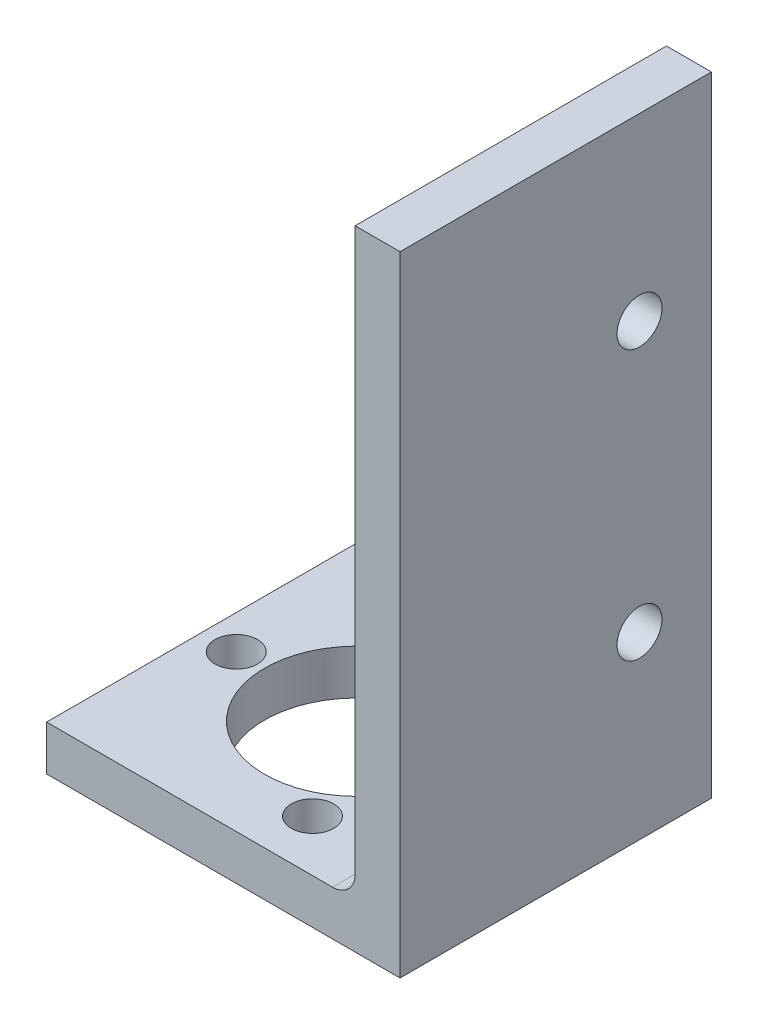
ISO-10303-21;
HEADER;
FILE_DESCRIPTION(('STEP AP214'),'2;1');
FILE_NAME('part.step','',(''),(''),'','','');
FILE_SCHEMA(('AUTOMOTIVE_DESIGN { 1 0 10303 214 1 1 1 1 }'));
ENDSEC;
DATA;
#1=APPLICATION_CONTEXT('core data for automotive mechanical design processes');
#2=APPLICATION_PROTOCOL_DEFINITION('international standard','automotive_design',2000,#1);
#3=PRODUCT_CONTEXT('',#1,'mechanical');
#4=PRODUCT('Part','Part','',(#3));
#5=PRODUCT_RELATED_PRODUCT_CATEGORY('part','',(#4));
#6=PRODUCT_DEFINITION_FORMATION('','',#4);
#7=PRODUCT_DEFINITION_CONTEXT('part definition',#1,'design');
#8=PRODUCT_DEFINITION('design','',#6,#7);
#9=PRODUCT_DEFINITION_SHAPE('','',#8);
#10=(LENGTH_UNIT() NAMED_UNIT(*) SI_UNIT(.MILLI.,.METRE.));
#11=(NAMED_UNIT(*) PLANE_ANGLE_UNIT() SI_UNIT($,.RADIAN.));
#12=(NAMED_UNIT(*) SI_UNIT($,.STERADIAN.) SOLID_ANGLE_UNIT());
#13=UNCERTAINTY_MEASURE_WITH_UNIT(LENGTH_MEASURE(1.E-05),#10,'distance_accuracy_value','');
#14=(GEOMETRIC_REPRESENTATION_CONTEXT(3) GLOBAL_UNCERTAINTY_ASSIGNED_CONTEXT((#13)) GLOBAL_UNIT_ASSIGNED_CONTEXT((#10,
#11,#12)) REPRESENTATION_CONTEXT('',''));
#15=CARTESIAN_POINT('',(0.,0.,0.));
#16=DIRECTION('',(0.,0.,1.));
#17=DIRECTION('',(1.,0.,0.));
#18=AXIS2_PLACEMENT_3D('',#15,#16,#17);
#19=CARTESIAN_POINT('',(-25.4,0.,11.));
#20=DIRECTION('',(0.,1.,0.));
#21=DIRECTION('',(0.,0.,1.));
#22=AXIS2_PLACEMENT_3D('',#19,#20,#21);
#23=PLANE('',#22);
#24=CARTESIAN_POINT('',(2.82500000000003,0.,0.));
#25=DIRECTION('',(0.,-1.,0.));
#26=DIRECTION('',(0.,0.,-1.));
#27=AXIS2_PLACEMENT_3D('',#24,#25,#26);
#28=CIRCLE('',#27,1.5);
#29=CARTESIAN_POINT('',(2.82500000000003,0.,-1.50000000000003));
#30=VERTEX_POINT('',#29);
#31=EDGE_CURVE('E114',#30,#30,#28,.T.);
#32=ORIENTED_EDGE('',*,*,#31,.F.);
#33=EDGE_LOOP('',(#32));
#34=FACE_BOUND('',#33,.T.);
#35=CARTESIAN_POINT('',(15.575,0.,7.3612159322));
#36=DIRECTION('',(0.,-1.,0.));
#37=DIRECTION('',(0.,0.,-1.));
#38=AXIS2_PLACEMENT_3D('',#35,#36,#37);
#39=CIRCLE('',#38,1.5);
#40=CARTESIAN_POINT('',(15.575,0.,5.8612159322));
#41=VERTEX_POINT('',#40);
#42=EDGE_CURVE('E192',#41,#41,#39,.T.);
#43=ORIENTED_EDGE('',*,*,#42,.F.);
#44=EDGE_LOOP('',(#43));
#45=FACE_BOUND('',#44,.T.);
#46=CARTESIAN_POINT('',(11.325,0.,0.));
#47=DIRECTION('',(0.,-1.,0.));
#48=DIRECTION('',(0.,0.,-1.));
#49=AXIS2_PLACEMENT_3D('',#46,#47,#48);
#50=CIRCLE('',#49,6.5);
#51=CARTESIAN_POINT('',(11.325,0.,-6.50000000000001));
#52=VERTEX_POINT('',#51);
#53=EDGE_CURVE('E178',#52,#52,#50,.T.);
#54=ORIENTED_EDGE('',*,*,#53,.F.);
#55=EDGE_LOOP('',(#54));
#56=FACE_BOUND('',#55,.T.);
#57=CARTESIAN_POINT('',(15.575,0.,-7.36121593220001));
#58=DIRECTION('',(0.,-1.,0.));
#59=DIRECTION('',(0.,0.,-1.));
#60=AXIS2_PLACEMENT_3D('',#57,#58,#59);
#61=CIRCLE('',#60,1.49999999999999);
#62=CARTESIAN_POINT('',(15.575,0.,-8.8612159322));
#63=VERTEX_POINT('',#62);
#64=EDGE_CURVE('E189',#63,#63,#61,.T.);
#65=ORIENTED_EDGE('',*,*,#64,.F.);
#66=EDGE_LOOP('',(#65));
#67=FACE_BOUND('',#66,.T.);
#68=DIRECTION('',(0.,0.,-1.));
#69=VECTOR('',#68,1.);
#70=CARTESIAN_POINT('',(0.425000000000033,0.,0.));
#71=LINE('',#70,#69);
#72=CARTESIAN_POINT('',(0.425000000000033,0.,11.));
#73=VERTEX_POINT('',#72);
#74=CARTESIAN_POINT('',(0.425000000000033,0.,-11.));
#75=VERTEX_POINT('',#74);
#76=EDGE_CURVE('E107',#73,#75,#71,.T.);
#77=ORIENTED_EDGE('',*,*,#76,.T.);
#78=DIRECTION('',(1.,0.,0.));
#79=VECTOR('',#78,1.);
#80=CARTESIAN_POINT('',(-25.4,0.,-11.));
#81=LINE('',#80,#79);
#82=CARTESIAN_POINT('',(25.4,0.,-11.));
#83=VERTEX_POINT('',#82);
#84=EDGE_CURVE('E141',#75,#83,#81,.T.);
#85=ORIENTED_EDGE('',*,*,#84,.T.);
#86=DIRECTION('',(0.,0.,-1.));
#87=VECTOR('',#86,1.);
#88=CARTESIAN_POINT('',(25.4,0.,11.));
#89=LINE('',#88,#87);
#90=CARTESIAN_POINT('',(25.4,0.,11.));
#91=VERTEX_POINT('',#90);
#92=EDGE_CURVE('E126',#91,#83,#89,.T.);
#93=ORIENTED_EDGE('',*,*,#92,.F.);
#94=DIRECTION('',(1.,0.,0.));
#95=VECTOR('',#94,1.);
#96=CARTESIAN_POINT('',(-25.4,0.,11.));
#97=LINE('',#96,#95);
#98=EDGE_CURVE('E120',#73,#91,#97,.T.);
#99=ORIENTED_EDGE('',*,*,#98,.F.);
#100=EDGE_LOOP('',(#77,#85,#93,#99));
#101=FACE_BOUND('',#100,.T.);
#102=ADVANCED_FACE('F49',(#34,#45,#56,#67,#101),#23,.F.);
#103=CARTESIAN_POINT('',(22.225,3.17499999999999,11.));
#104=DIRECTION('',(0.,-1.,0.));
#105=DIRECTION('',(1.,0.,0.));
#106=AXIS2_PLACEMENT_3D('',#103,#104,#105);
#107=PLANE('',#106);
#108=CARTESIAN_POINT('',(2.82500000000003,3.175,0.));
#109=DIRECTION('',(0.,-1.,0.));
#110=DIRECTION('',(1.,0.,0.));
#111=AXIS2_PLACEMENT_3D('',#108,#109,#110);
#112=CIRCLE('',#111,1.5);
#113=CARTESIAN_POINT('',(4.32500000000003,3.175,0.));
#114=VERTEX_POINT('',#113);
#115=EDGE_CURVE('E160',#114,#114,#112,.T.);
#116=ORIENTED_EDGE('',*,*,#115,.T.);
#117=EDGE_LOOP('',(#116));
#118=FACE_BOUND('',#117,.T.);
#119=CARTESIAN_POINT('',(15.575,3.175,7.3612159322));
#120=DIRECTION('',(0.,-1.,0.));
#121=DIRECTION('',(1.,0.,0.));
#122=AXIS2_PLACEMENT_3D('',#119,#120,#121);
#123=CIRCLE('',#122,1.5);
#124=CARTESIAN_POINT('',(17.075,3.175,7.3612159322));
#125=VERTEX_POINT('',#124);
#126=EDGE_CURVE('E163',#125,#125,#123,.T.);
#127=ORIENTED_EDGE('',*,*,#126,.T.);
#128=EDGE_LOOP('',(#127));
#129=FACE_BOUND('',#128,.T.);
#130=CARTESIAN_POINT('',(11.325,3.175,0.));
#131=DIRECTION('',(0.,-1.,0.));
#132=DIRECTION('',(1.,0.,0.));
#133=AXIS2_PLACEMENT_3D('',#130,#131,#132);
#134=CIRCLE('',#133,6.5);
#135=CARTESIAN_POINT('',(17.825,3.175,0.));
#136=VERTEX_POINT('',#135);
#137=EDGE_CURVE('E166',#136,#136,#134,.T.);
#138=ORIENTED_EDGE('',*,*,#137,.T.);
#139=EDGE_LOOP('',(#138));
#140=FACE_BOUND('',#139,.T.);
#141=CARTESIAN_POINT('',(15.575,3.175,-7.36121593220001));
#142=DIRECTION('',(0.,-1.,0.));
#143=DIRECTION('',(1.,0.,0.));
#144=AXIS2_PLACEMENT_3D('',#141,#142,#143);
#145=CIRCLE('',#144,1.49999999999999);
#146=CARTESIAN_POINT('',(17.075,3.175,-7.36121593220001));
#147=VERTEX_POINT('',#146);
#148=EDGE_CURVE('E169',#147,#147,#145,.T.);
#149=ORIENTED_EDGE('',*,*,#148,.T.);
#150=EDGE_LOOP('',(#149));
#151=FACE_BOUND('',#150,.T.);
#152=DIRECTION('',(0.,0.,-1.));
#153=VECTOR('',#152,1.);
#154=CARTESIAN_POINT('',(0.425000000000033,3.17499999999999,11.));
#155=LINE('',#154,#153);
#156=CARTESIAN_POINT('',(0.425000000000033,3.175,11.));
#157=VERTEX_POINT('',#156);
#158=CARTESIAN_POINT('',(0.425000000000033,3.17499999999999,-11.));
#159=VERTEX_POINT('',#158);
#160=EDGE_CURVE('E65',#157,#159,#155,.T.);
#161=ORIENTED_EDGE('',*,*,#160,.F.);
#162=DIRECTION('',(-1.,0.,0.));
#163=VECTOR('',#162,1.);
#164=CARTESIAN_POINT('',(22.225,3.17499999999999,11.));
#165=LINE('',#164,#163);
#166=CARTESIAN_POINT('',(20.6375,3.17499999999999,11.));
#167=VERTEX_POINT('',#166);
#168=EDGE_CURVE('E123',#167,#157,#165,.T.);
#169=ORIENTED_EDGE('',*,*,#168,.F.);
#170=DIRECTION('',(0.,0.,-1.));
#171=VECTOR('',#170,1.);
#172=CARTESIAN_POINT('',(20.6375,3.17499999999999,-11.));
#173=LINE('',#172,#171);
#174=CARTESIAN_POINT('',(20.6375,3.17499999999999,-11.));
#175=VERTEX_POINT('',#174);
#176=EDGE_CURVE('E148',#167,#175,#173,.T.);
#177=ORIENTED_EDGE('',*,*,#176,.T.);
#178=DIRECTION('',(-1.,0.,0.));
#179=VECTOR('',#178,1.);
#180=CARTESIAN_POINT('',(22.225,3.17499999999999,-11.));
#181=LINE('',#180,#179);
#182=EDGE_CURVE('E129',#175,#159,#181,.T.);
#183=ORIENTED_EDGE('',*,*,#182,.T.);
#184=EDGE_LOOP('',(#161,#169,#177,#183));
#185=FACE_BOUND('',#184,.T.);
#186=ADVANCED_FACE('F213',(#118,#129,#140,#151,#185),#107,.F.);
#187=CARTESIAN_POINT('',(-25.4,3.175,11.));
#188=DIRECTION('',(0.,0.,1.));
#189=DIRECTION('',(1.,0.,0.));
#190=AXIS2_PLACEMENT_3D('',#187,#188,#189);
#191=PLANE('',#190);
#192=ORIENTED_EDGE('',*,*,#168,.T.);
#193=DIRECTION('',(0.,-1.,0.));
#194=VECTOR('',#193,1.);
#195=CARTESIAN_POINT('',(0.425000000000033,44.45,11.));
#196=LINE('',#195,#194);
#197=EDGE_CURVE('E110',#157,#73,#196,.T.);
#198=ORIENTED_EDGE('',*,*,#197,.T.);
#199=ORIENTED_EDGE('',*,*,#98,.T.);
#200=DIRECTION('',(0.,1.,0.));
#201=VECTOR('',#200,1.);
#202=CARTESIAN_POINT('',(25.4,0.,11.));
#203=LINE('',#202,#201);
#204=CARTESIAN_POINT('',(25.4,44.45,11.));
#205=VERTEX_POINT('',#204);
#206=EDGE_CURVE('E128',#91,#205,#203,.T.);
#207=ORIENTED_EDGE('',*,*,#206,.T.);
#208=DIRECTION('',(1.,0.,0.));
#209=VECTOR('',#208,1.);
#210=CARTESIAN_POINT('',(6.05907768448333,44.45,11.));
#211=LINE('',#210,#209);
#212=CARTESIAN_POINT('',(22.225,44.45,11.));
#213=VERTEX_POINT('',#212);
#214=EDGE_CURVE('E171',#213,#205,#211,.T.);
#215=ORIENTED_EDGE('',*,*,#214,.F.);
#216=DIRECTION('',(0.,-1.,0.));
#217=VECTOR('',#216,1.);
#218=CARTESIAN_POINT('',(22.225,50.8,11.));
#219=LINE('',#218,#217);
#220=CARTESIAN_POINT('',(22.225,4.7625,11.));
#221=VERTEX_POINT('',#220);
#222=EDGE_CURVE('E131',#213,#221,#219,.T.);
#223=ORIENTED_EDGE('',*,*,#222,.T.);
#224=CARTESIAN_POINT('',(20.6375,4.76249999999999,11.));
#225=DIRECTION('',(0.,0.,1.));
#226=DIRECTION('',(1.,0.,0.));
#227=AXIS2_PLACEMENT_3D('',#224,#225,#226);
#228=CIRCLE('',#227,1.5875);
#229=EDGE_CURVE('E157',#221,#167,#228,.F.);
#230=ORIENTED_EDGE('',*,*,#229,.T.);
#231=EDGE_LOOP('',(#192,#198,#199,#207,#215,#223,#230));
#232=FACE_BOUND('',#231,.T.);
#233=ADVANCED_FACE('F118',(#232),#191,.T.);
#234=CARTESIAN_POINT('',(-25.4,3.175,-11.));
#235=DIRECTION('',(0.,0.,1.));
#236=DIRECTION('',(1.,0.,0.));
#237=AXIS2_PLACEMENT_3D('',#234,#235,#236);
#238=PLANE('',#237);
#239=DIRECTION('',(0.,-1.,0.));
#240=VECTOR('',#239,1.);
#241=CARTESIAN_POINT('',(0.425000000000033,3.175,-11.));
#242=LINE('',#241,#240);
#243=EDGE_CURVE('E12',#159,#75,#242,.T.);
#244=ORIENTED_EDGE('',*,*,#243,.F.);
#245=ORIENTED_EDGE('',*,*,#182,.F.);
#246=CARTESIAN_POINT('',(20.6375,4.76249999999999,-11.));
#247=DIRECTION('',(0.,0.,1.));
#248=DIRECTION('',(1.,0.,0.));
#249=AXIS2_PLACEMENT_3D('',#246,#247,#248);
#250=CIRCLE('',#249,1.5875);
#251=CARTESIAN_POINT('',(22.225,4.7625,-11.));
#252=VERTEX_POINT('',#251);
#253=EDGE_CURVE('E154',#175,#252,#250,.T.);
#254=ORIENTED_EDGE('',*,*,#253,.T.);
#255=DIRECTION('',(0.,-1.,0.));
#256=VECTOR('',#255,1.);
#257=CARTESIAN_POINT('',(22.225,50.8,-11.));
#258=LINE('',#257,#256);
#259=CARTESIAN_POINT('',(22.225,44.45,-11.));
#260=VERTEX_POINT('',#259);
#261=EDGE_CURVE('E134',#260,#252,#258,.T.);
#262=ORIENTED_EDGE('',*,*,#261,.F.);
#263=DIRECTION('',(1.,0.,0.));
#264=VECTOR('',#263,1.);
#265=CARTESIAN_POINT('',(-25.4,44.45,-11.));
#266=LINE('',#265,#264);
#267=CARTESIAN_POINT('',(25.4,44.45,-11.));
#268=VERTEX_POINT('',#267);
#269=EDGE_CURVE('E58',#260,#268,#266,.T.);
#270=ORIENTED_EDGE('',*,*,#269,.T.);
#271=DIRECTION('',(0.,1.,0.));
#272=VECTOR('',#271,1.);
#273=CARTESIAN_POINT('',(25.4,0.,-11.));
#274=LINE('',#273,#272);
#275=EDGE_CURVE('E143',#83,#268,#274,.T.);
#276=ORIENTED_EDGE('',*,*,#275,.F.);
#277=ORIENTED_EDGE('',*,*,#84,.F.);
#278=EDGE_LOOP('',(#244,#245,#254,#262,#270,#276,#277));
#279=FACE_BOUND('',#278,.T.);
#280=ADVANCED_FACE('F216',(#279),#238,.F.);
#281=CARTESIAN_POINT('',(25.4,0.,11.));
#282=DIRECTION('',(-1.,0.,0.));
#283=DIRECTION('',(0.,0.,1.));
#284=AXIS2_PLACEMENT_3D('',#281,#282,#283);
#285=PLANE('',#284);
#286=CARTESIAN_POINT('',(25.4,31.75,-5.92));
#287=DIRECTION('',(1.,0.,0.));
#288=DIRECTION('',(0.,0.,-1.));
#289=AXIS2_PLACEMENT_3D('',#286,#287,#288);
#290=CIRCLE('',#289,1.5875);
#291=CARTESIAN_POINT('',(25.4,31.75,-7.5075));
#292=VERTEX_POINT('',#291);
#293=EDGE_CURVE('E174',#292,#292,#290,.T.);
#294=ORIENTED_EDGE('',*,*,#293,.F.);
#295=EDGE_LOOP('',(#294));
#296=FACE_BOUND('',#295,.T.);
#297=CARTESIAN_POINT('',(25.4,12.7,-5.92));
#298=DIRECTION('',(1.,0.,0.));
#299=DIRECTION('',(0.,0.,-1.));
#300=AXIS2_PLACEMENT_3D('',#297,#298,#299);
#301=CIRCLE('',#300,1.5875);
#302=CARTESIAN_POINT('',(25.4,12.7,-7.5075));
#303=VERTEX_POINT('',#302);
#304=EDGE_CURVE('E180',#303,#303,#301,.T.);
#305=ORIENTED_EDGE('',*,*,#304,.F.);
#306=EDGE_LOOP('',(#305));
#307=FACE_BOUND('',#306,.T.);
#308=ORIENTED_EDGE('',*,*,#275,.T.);
#309=DIRECTION('',(0.,0.,1.));
#310=VECTOR('',#309,1.);
#311=CARTESIAN_POINT('',(25.4,44.45,11.));
#312=LINE('',#311,#310);
#313=EDGE_CURVE('E73',#268,#205,#312,.T.);
#314=ORIENTED_EDGE('',*,*,#313,.T.);
#315=ORIENTED_EDGE('',*,*,#206,.F.);
#316=ORIENTED_EDGE('',*,*,#92,.T.);
#317=EDGE_LOOP('',(#308,#314,#315,#316));
#318=FACE_BOUND('',#317,.T.);
#319=ADVANCED_FACE('F204',(#296,#307,#318),#285,.F.);
#320=CARTESIAN_POINT('',(22.225,50.8,11.));
#321=DIRECTION('',(1.,0.,0.));
#322=DIRECTION('',(0.,1.,0.));
#323=AXIS2_PLACEMENT_3D('',#320,#321,#322);
#324=PLANE('',#323);
#325=CARTESIAN_POINT('',(22.225,31.75,-5.92));
#326=DIRECTION('',(1.,0.,0.));
#327=DIRECTION('',(0.,1.,0.));
#328=AXIS2_PLACEMENT_3D('',#325,#326,#327);
#329=CIRCLE('',#328,1.5875);
#330=CARTESIAN_POINT('',(22.225,33.3375,-5.92));
#331=VERTEX_POINT('',#330);
#332=EDGE_CURVE('E53',#331,#331,#329,.T.);
#333=ORIENTED_EDGE('',*,*,#332,.T.);
#334=EDGE_LOOP('',(#333));
#335=FACE_BOUND('',#334,.T.);
#336=CARTESIAN_POINT('',(22.225,12.7,-5.92));
#337=DIRECTION('',(1.,0.,0.));
#338=DIRECTION('',(0.,1.,0.));
#339=AXIS2_PLACEMENT_3D('',#336,#337,#338);
#340=CIRCLE('',#339,1.5875);
#341=CARTESIAN_POINT('',(22.225,14.2875,-5.92));
#342=VERTEX_POINT('',#341);
#343=EDGE_CURVE('E172',#342,#342,#340,.T.);
#344=ORIENTED_EDGE('',*,*,#343,.T.);
#345=EDGE_LOOP('',(#344));
#346=FACE_BOUND('',#345,.T.);
#347=ORIENTED_EDGE('',*,*,#222,.F.);
#348=DIRECTION('',(0.,0.,-1.));
#349=VECTOR('',#348,1.);
#350=CARTESIAN_POINT('',(22.225,44.45,11.));
#351=LINE('',#350,#349);
#352=EDGE_CURVE('E198',#213,#260,#351,.T.);
#353=ORIENTED_EDGE('',*,*,#352,.T.);
#354=ORIENTED_EDGE('',*,*,#261,.T.);
#355=DIRECTION('',(0.,0.,-1.));
#356=VECTOR('',#355,1.);
#357=CARTESIAN_POINT('',(22.225,4.76249999999999,11.));
#358=LINE('',#357,#356);
#359=EDGE_CURVE('E151',#252,#221,#358,.F.);
#360=ORIENTED_EDGE('',*,*,#359,.T.);
#361=EDGE_LOOP('',(#347,#353,#354,#360));
#362=FACE_BOUND('',#361,.T.);
#363=ADVANCED_FACE('F207',(#335,#346,#362),#324,.F.);
#364=CARTESIAN_POINT('',(20.6375,4.76249999999999,11.));
#365=DIRECTION('',(0.,0.,1.));
#366=DIRECTION('',(1.,0.,0.));
#367=AXIS2_PLACEMENT_3D('',#364,#365,#366);
#368=CYLINDRICAL_SURFACE('',#367,1.5875);
#369=ORIENTED_EDGE('',*,*,#229,.F.);
#370=ORIENTED_EDGE('',*,*,#359,.F.);
#371=ORIENTED_EDGE('',*,*,#253,.F.);
#372=ORIENTED_EDGE('',*,*,#176,.F.);
#373=EDGE_LOOP('',(#369,#370,#371,#372));
#374=FACE_BOUND('',#373,.T.);
#375=ADVANCED_FACE('F51',(#374),#368,.F.);
#376=CARTESIAN_POINT('',(6.05907768448333,44.45,-11.));
#377=DIRECTION('',(0.,-1.,0.));
#378=DIRECTION('',(0.,0.,-1.));
#379=AXIS2_PLACEMENT_3D('',#376,#377,#378);
#380=PLANE('',#379);
#381=ORIENTED_EDGE('',*,*,#269,.F.);
#382=ORIENTED_EDGE('',*,*,#352,.F.);
#383=ORIENTED_EDGE('',*,*,#214,.T.);
#384=ORIENTED_EDGE('',*,*,#313,.F.);
#385=EDGE_LOOP('',(#381,#382,#383,#384));
#386=FACE_BOUND('',#385,.T.);
#387=ADVANCED_FACE('F217',(#386),#380,.F.);
#388=CARTESIAN_POINT('',(0.425000000000033,44.45,0.));
#389=DIRECTION('',(-1.,0.,0.));
#390=DIRECTION('',(0.,0.,1.));
#391=AXIS2_PLACEMENT_3D('',#388,#389,#390);
#392=PLANE('',#391);
#393=ORIENTED_EDGE('',*,*,#160,.T.);
#394=ORIENTED_EDGE('',*,*,#243,.T.);
#395=ORIENTED_EDGE('',*,*,#76,.F.);
#396=ORIENTED_EDGE('',*,*,#197,.F.);
#397=EDGE_LOOP('',(#393,#394,#395,#396));
#398=FACE_BOUND('',#397,.T.);
#399=ADVANCED_FACE('F109',(#398),#392,.T.);
#400=CARTESIAN_POINT('',(2.82500000000003,44.45,0.));
#401=DIRECTION('',(0.,-1.,0.));
#402=DIRECTION('',(0.,0.,-1.));
#403=AXIS2_PLACEMENT_3D('',#400,#401,#402);
#404=CYLINDRICAL_SURFACE('',#403,1.5);
#405=ORIENTED_EDGE('',*,*,#31,.T.);
#406=EDGE_LOOP('',(#405));
#407=FACE_BOUND('',#406,.T.);
#408=ORIENTED_EDGE('',*,*,#115,.F.);
#409=EDGE_LOOP('',(#408));
#410=FACE_BOUND('',#409,.T.);
#411=ADVANCED_FACE('F224',(#407,#410),#404,.F.);
#412=CARTESIAN_POINT('',(15.575,44.45,7.3612159322));
#413=DIRECTION('',(0.,-1.,0.));
#414=DIRECTION('',(0.,0.,-1.));
#415=AXIS2_PLACEMENT_3D('',#412,#413,#414);
#416=CYLINDRICAL_SURFACE('',#415,1.5);
#417=ORIENTED_EDGE('',*,*,#42,.T.);
#418=EDGE_LOOP('',(#417));
#419=FACE_BOUND('',#418,.T.);
#420=ORIENTED_EDGE('',*,*,#126,.F.);
#421=EDGE_LOOP('',(#420));
#422=FACE_BOUND('',#421,.T.);
#423=ADVANCED_FACE('F303',(#419,#422),#416,.F.);
#424=CARTESIAN_POINT('',(11.325,44.45,0.));
#425=DIRECTION('',(0.,-1.,0.));
#426=DIRECTION('',(0.,0.,-1.));
#427=AXIS2_PLACEMENT_3D('',#424,#425,#426);
#428=CYLINDRICAL_SURFACE('',#427,6.5);
#429=ORIENTED_EDGE('',*,*,#53,.T.);
#430=EDGE_LOOP('',(#429));
#431=FACE_BOUND('',#430,.T.);
#432=ORIENTED_EDGE('',*,*,#137,.F.);
#433=EDGE_LOOP('',(#432));
#434=FACE_BOUND('',#433,.T.);
#435=ADVANCED_FACE('F315',(#431,#434),#428,.F.);
#436=CARTESIAN_POINT('',(15.575,44.45,-7.36121593220001));
#437=DIRECTION('',(0.,-1.,0.));
#438=DIRECTION('',(0.,0.,-1.));
#439=AXIS2_PLACEMENT_3D('',#436,#437,#438);
#440=CYLINDRICAL_SURFACE('',#439,1.49999999999999);
#441=ORIENTED_EDGE('',*,*,#64,.T.);
#442=EDGE_LOOP('',(#441));
#443=FACE_BOUND('',#442,.T.);
#444=ORIENTED_EDGE('',*,*,#148,.F.);
#445=EDGE_LOOP('',(#444));
#446=FACE_BOUND('',#445,.T.);
#447=ADVANCED_FACE('F326',(#443,#446),#440,.F.);
#448=CARTESIAN_POINT('',(0.425000000000033,12.7,-5.92));
#449=DIRECTION('',(1.,0.,0.));
#450=DIRECTION('',(0.,0.,-1.));
#451=AXIS2_PLACEMENT_3D('',#448,#449,#450);
#452=CYLINDRICAL_SURFACE('',#451,1.5875);
#453=ORIENTED_EDGE('',*,*,#304,.T.);
#454=EDGE_LOOP('',(#453));
#455=FACE_BOUND('',#454,.T.);
#456=ORIENTED_EDGE('',*,*,#343,.F.);
#457=EDGE_LOOP('',(#456));
#458=FACE_BOUND('',#457,.T.);
#459=ADVANCED_FACE('F334',(#455,#458),#452,.F.);
#460=CARTESIAN_POINT('',(0.425000000000033,31.75,-5.92));
#461=DIRECTION('',(1.,0.,0.));
#462=DIRECTION('',(0.,0.,-1.));
#463=AXIS2_PLACEMENT_3D('',#460,#461,#462);
#464=CYLINDRICAL_SURFACE('',#463,1.5875);
#465=ORIENTED_EDGE('',*,*,#293,.T.);
#466=EDGE_LOOP('',(#465));
#467=FACE_BOUND('',#466,.T.);
#468=ORIENTED_EDGE('',*,*,#332,.F.);
#469=EDGE_LOOP('',(#468));
#470=FACE_BOUND('',#469,.T.);
#471=ADVANCED_FACE('F345',(#467,#470),#464,.F.);
#472=CLOSED_SHELL('',(#102,#186,#233,#280,#319,#363,#375,#387,#399,#411,#423,#435,#447,#459,#471));
#473=MANIFOLD_SOLID_BREP('B2',#472);
#474=ADVANCED_BREP_SHAPE_REPRESENTATION('',(#18,#473),#14);
#475=SHAPE_DEFINITION_REPRESENTATION(#9,#474);
ENDSEC;
END-ISO-10303-21;
